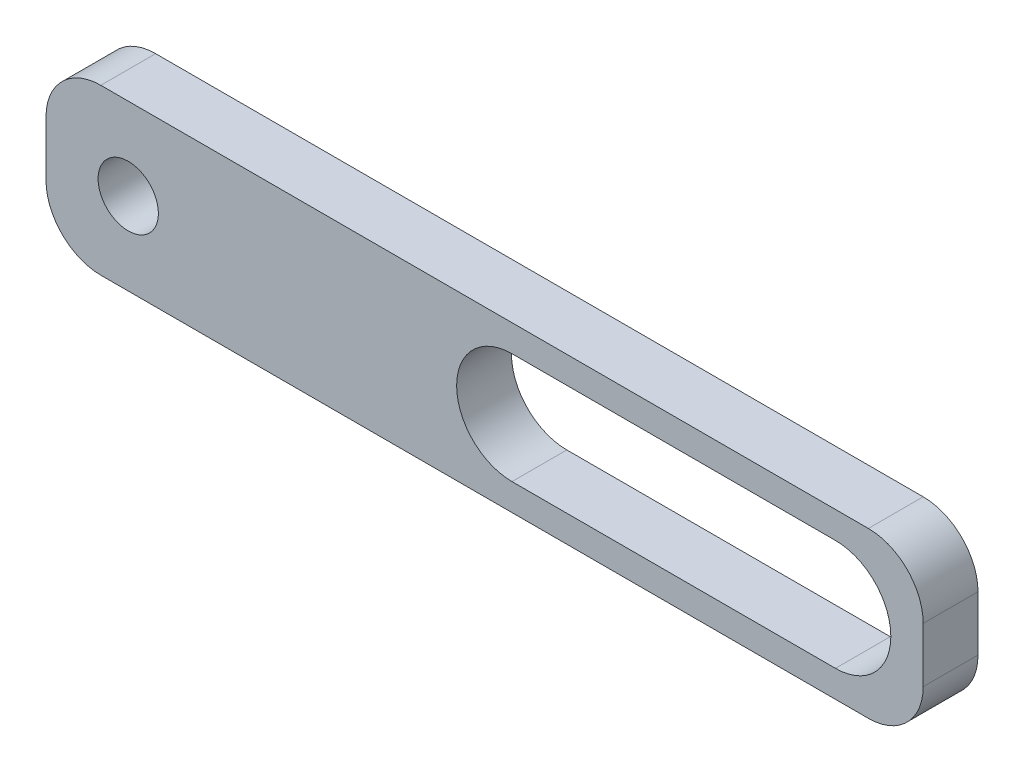
ISO-10303-21;
HEADER;
FILE_DESCRIPTION(('STEP AP214'),'2;1');
FILE_NAME('part.step','',(''),(''),'','','');
FILE_SCHEMA(('AUTOMOTIVE_DESIGN { 1 0 10303 214 1 1 1 1 }'));
ENDSEC;
DATA;
#1=APPLICATION_CONTEXT('core data for automotive mechanical design processes');
#2=APPLICATION_PROTOCOL_DEFINITION('international standard','automotive_design',2000,#1);
#3=PRODUCT_CONTEXT('',#1,'mechanical');
#4=PRODUCT('Part','Part','',(#3));
#5=PRODUCT_RELATED_PRODUCT_CATEGORY('part','',(#4));
#6=PRODUCT_DEFINITION_FORMATION('','',#4);
#7=PRODUCT_DEFINITION_CONTEXT('part definition',#1,'design');
#8=PRODUCT_DEFINITION('design','',#6,#7);
#9=PRODUCT_DEFINITION_SHAPE('','',#8);
#10=(LENGTH_UNIT() NAMED_UNIT(*) SI_UNIT(.MILLI.,.METRE.));
#11=(NAMED_UNIT(*) PLANE_ANGLE_UNIT() SI_UNIT($,.RADIAN.));
#12=(NAMED_UNIT(*) SI_UNIT($,.STERADIAN.) SOLID_ANGLE_UNIT());
#13=UNCERTAINTY_MEASURE_WITH_UNIT(LENGTH_MEASURE(1.E-05),#10,'distance_accuracy_value','');
#14=(GEOMETRIC_REPRESENTATION_CONTEXT(3) GLOBAL_UNCERTAINTY_ASSIGNED_CONTEXT((#13)) GLOBAL_UNIT_ASSIGNED_CONTEXT((#10,
#11,#12)) REPRESENTATION_CONTEXT('',''));
#15=CARTESIAN_POINT('',(0.,0.,0.));
#16=DIRECTION('',(0.,0.,1.));
#17=DIRECTION('',(1.,0.,0.));
#18=AXIS2_PLACEMENT_3D('',#15,#16,#17);
#19=CARTESIAN_POINT('',(5.,5.,5.));
#20=DIRECTION('',(0.,0.,-1.));
#21=DIRECTION('',(-1.,0.,0.));
#22=AXIS2_PLACEMENT_3D('',#19,#20,#21);
#23=PLANE('',#22);
#24=CARTESIAN_POINT('',(5.,5.,5.));
#25=DIRECTION('',(0.,0.,1.));
#26=DIRECTION('',(-1.,0.,0.));
#27=AXIS2_PLACEMENT_3D('',#24,#25,#26);
#28=CIRCLE('',#27,5.);
#29=CARTESIAN_POINT('',(0.,5.00000000000004,5.));
#30=VERTEX_POINT('',#29);
#31=CARTESIAN_POINT('',(5.00000000000004,0.,5.));
#32=VERTEX_POINT('',#31);
#33=EDGE_CURVE('E180',#30,#32,#28,.T.);
#34=ORIENTED_EDGE('',*,*,#33,.T.);
#35=DIRECTION('',(1.,0.,0.));
#36=VECTOR('',#35,1.);
#37=CARTESIAN_POINT('',(75.,0.,5.));
#38=LINE('',#37,#36);
#39=CARTESIAN_POINT('',(75.,0.,5.));
#40=VERTEX_POINT('',#39);
#41=EDGE_CURVE('E184',#32,#40,#38,.T.);
#42=ORIENTED_EDGE('',*,*,#41,.T.);
#43=CARTESIAN_POINT('',(75.,5.,5.));
#44=DIRECTION('',(0.,0.,1.));
#45=DIRECTION('',(1.,0.,0.));
#46=AXIS2_PLACEMENT_3D('',#43,#44,#45);
#47=CIRCLE('',#46,5.00000000000001);
#48=CARTESIAN_POINT('',(80.,5.,5.));
#49=VERTEX_POINT('',#48);
#50=EDGE_CURVE('E188',#40,#49,#47,.T.);
#51=ORIENTED_EDGE('',*,*,#50,.T.);
#52=DIRECTION('',(0.,1.,0.));
#53=VECTOR('',#52,1.);
#54=CARTESIAN_POINT('',(80.,9.99999999999999,5.));
#55=LINE('',#54,#53);
#56=CARTESIAN_POINT('',(80.,9.99999999999999,5.));
#57=VERTEX_POINT('',#56);
#58=EDGE_CURVE('E191',#49,#57,#55,.T.);
#59=ORIENTED_EDGE('',*,*,#58,.T.);
#60=CARTESIAN_POINT('',(75.,9.99999999999999,5.));
#61=DIRECTION('',(0.,0.,1.));
#62=DIRECTION('',(1.,0.,0.));
#63=AXIS2_PLACEMENT_3D('',#60,#61,#62);
#64=CIRCLE('',#63,5.);
#65=CARTESIAN_POINT('',(75.,15.,5.));
#66=VERTEX_POINT('',#65);
#67=EDGE_CURVE('E194',#57,#66,#64,.T.);
#68=ORIENTED_EDGE('',*,*,#67,.T.);
#69=DIRECTION('',(-1.,0.,0.));
#70=VECTOR('',#69,1.);
#71=CARTESIAN_POINT('',(5.,15.,5.));
#72=LINE('',#71,#70);
#73=CARTESIAN_POINT('',(5.,15.,5.));
#74=VERTEX_POINT('',#73);
#75=EDGE_CURVE('E197',#66,#74,#72,.T.);
#76=ORIENTED_EDGE('',*,*,#75,.T.);
#77=CARTESIAN_POINT('',(5.,9.99999999999999,5.));
#78=DIRECTION('',(0.,0.,1.));
#79=DIRECTION('',(-1.,0.,0.));
#80=AXIS2_PLACEMENT_3D('',#77,#78,#79);
#81=CIRCLE('',#80,5.);
#82=CARTESIAN_POINT('',(0.,9.99999999999999,5.));
#83=VERTEX_POINT('',#82);
#84=EDGE_CURVE('E200',#74,#83,#81,.T.);
#85=ORIENTED_EDGE('',*,*,#84,.T.);
#86=DIRECTION('',(0.,-1.,0.));
#87=VECTOR('',#86,1.);
#88=CARTESIAN_POINT('',(0.,5.00000000000004,5.));
#89=LINE('',#88,#87);
#90=EDGE_CURVE('E203',#83,#30,#89,.T.);
#91=ORIENTED_EDGE('',*,*,#90,.T.);
#92=EDGE_LOOP('',(#34,#42,#51,#59,#68,#76,#85,#91));
#93=FACE_BOUND('',#92,.T.);
#94=CARTESIAN_POINT('',(42.5,7.50000000000001,5.));
#95=DIRECTION('',(0.,0.,1.));
#96=DIRECTION('',(1.,0.,0.));
#97=AXIS2_PLACEMENT_3D('',#94,#95,#96);
#98=CIRCLE('',#97,5.05);
#99=CARTESIAN_POINT('',(42.5,12.55,5.));
#100=VERTEX_POINT('',#99);
#101=CARTESIAN_POINT('',(42.5,2.45000000000001,5.));
#102=VERTEX_POINT('',#101);
#103=EDGE_CURVE('E129',#100,#102,#98,.T.);
#104=ORIENTED_EDGE('',*,*,#103,.F.);
#105=DIRECTION('',(-1.,0.,0.));
#106=VECTOR('',#105,1.);
#107=CARTESIAN_POINT('',(42.5,12.55,5.));
#108=LINE('',#107,#106);
#109=CARTESIAN_POINT('',(72.,12.55,5.));
#110=VERTEX_POINT('',#109);
#111=EDGE_CURVE('E156',#110,#100,#108,.T.);
#112=ORIENTED_EDGE('',*,*,#111,.F.);
#113=CARTESIAN_POINT('',(72.,7.50000000000001,5.));
#114=DIRECTION('',(0.,0.,1.));
#115=DIRECTION('',(1.,0.,0.));
#116=AXIS2_PLACEMENT_3D('',#113,#114,#115);
#117=CIRCLE('',#116,5.04999999999999);
#118=CARTESIAN_POINT('',(72.,2.45000000000001,5.));
#119=VERTEX_POINT('',#118);
#120=EDGE_CURVE('E152',#119,#110,#117,.T.);
#121=ORIENTED_EDGE('',*,*,#120,.F.);
#122=DIRECTION('',(1.,0.,0.));
#123=VECTOR('',#122,1.);
#124=CARTESIAN_POINT('',(42.5,2.45000000000001,5.));
#125=LINE('',#124,#123);
#126=EDGE_CURVE('E138',#102,#119,#125,.T.);
#127=ORIENTED_EDGE('',*,*,#126,.F.);
#128=EDGE_LOOP('',(#104,#112,#121,#127));
#129=FACE_BOUND('',#128,.T.);
#130=CARTESIAN_POINT('',(7.5,7.50000000000001,5.));
#131=DIRECTION('',(0.,0.,1.));
#132=DIRECTION('',(1.,0.,0.));
#133=AXIS2_PLACEMENT_3D('',#130,#131,#132);
#134=CIRCLE('',#133,2.75);
#135=CARTESIAN_POINT('',(10.25,7.50000000000001,5.));
#136=VERTEX_POINT('',#135);
#137=EDGE_CURVE('E164',#136,#136,#134,.T.);
#138=ORIENTED_EDGE('',*,*,#137,.F.);
#139=EDGE_LOOP('',(#138));
#140=FACE_BOUND('',#139,.T.);
#141=ADVANCED_FACE('F39',(#93,#129,#140),#23,.F.);
#142=CARTESIAN_POINT('',(5.,5.,0.));
#143=DIRECTION('',(0.,0.,-1.));
#144=DIRECTION('',(-1.,0.,0.));
#145=AXIS2_PLACEMENT_3D('',#142,#143,#144);
#146=PLANE('',#145);
#147=DIRECTION('',(-1.,0.,0.));
#148=VECTOR('',#147,1.);
#149=CARTESIAN_POINT('',(42.5,12.55,0.));
#150=LINE('',#149,#148);
#151=CARTESIAN_POINT('',(72.,12.55,0.));
#152=VERTEX_POINT('',#151);
#153=CARTESIAN_POINT('',(42.5,12.55,0.));
#154=VERTEX_POINT('',#153);
#155=EDGE_CURVE('E139',#152,#154,#150,.T.);
#156=ORIENTED_EDGE('',*,*,#155,.T.);
#157=CARTESIAN_POINT('',(42.5,7.50000000000001,0.));
#158=DIRECTION('',(0.,0.,1.));
#159=DIRECTION('',(1.,0.,0.));
#160=AXIS2_PLACEMENT_3D('',#157,#158,#159);
#161=CIRCLE('',#160,5.05);
#162=CARTESIAN_POINT('',(42.5,2.45000000000001,0.));
#163=VERTEX_POINT('',#162);
#164=EDGE_CURVE('E63',#154,#163,#161,.T.);
#165=ORIENTED_EDGE('',*,*,#164,.T.);
#166=DIRECTION('',(1.,0.,0.));
#167=VECTOR('',#166,1.);
#168=CARTESIAN_POINT('',(42.5,2.45000000000001,0.));
#169=LINE('',#168,#167);
#170=CARTESIAN_POINT('',(72.,2.45000000000001,0.));
#171=VERTEX_POINT('',#170);
#172=EDGE_CURVE('E145',#163,#171,#169,.T.);
#173=ORIENTED_EDGE('',*,*,#172,.T.);
#174=CARTESIAN_POINT('',(72.,7.50000000000001,0.));
#175=DIRECTION('',(0.,0.,1.));
#176=DIRECTION('',(1.,0.,0.));
#177=AXIS2_PLACEMENT_3D('',#174,#175,#176);
#178=CIRCLE('',#177,5.04999999999999);
#179=EDGE_CURVE('E167',#171,#152,#178,.T.);
#180=ORIENTED_EDGE('',*,*,#179,.T.);
#181=EDGE_LOOP('',(#156,#165,#173,#180));
#182=FACE_BOUND('',#181,.T.);
#183=CARTESIAN_POINT('',(5.,5.,0.));
#184=DIRECTION('',(0.,0.,1.));
#185=DIRECTION('',(-1.,0.,0.));
#186=AXIS2_PLACEMENT_3D('',#183,#184,#185);
#187=CIRCLE('',#186,5.);
#188=CARTESIAN_POINT('',(0.,5.00000000000004,0.));
#189=VERTEX_POINT('',#188);
#190=CARTESIAN_POINT('',(5.00000000000004,0.,0.));
#191=VERTEX_POINT('',#190);
#192=EDGE_CURVE('E147',#189,#191,#187,.T.);
#193=ORIENTED_EDGE('',*,*,#192,.F.);
#194=DIRECTION('',(0.,-1.,0.));
#195=VECTOR('',#194,1.);
#196=CARTESIAN_POINT('',(0.,5.00000000000004,0.));
#197=LINE('',#196,#195);
#198=CARTESIAN_POINT('',(0.,9.99999999999999,0.));
#199=VERTEX_POINT('',#198);
#200=EDGE_CURVE('E185',#199,#189,#197,.T.);
#201=ORIENTED_EDGE('',*,*,#200,.F.);
#202=CARTESIAN_POINT('',(5.,9.99999999999999,0.));
#203=DIRECTION('',(0.,0.,1.));
#204=DIRECTION('',(-1.,0.,0.));
#205=AXIS2_PLACEMENT_3D('',#202,#203,#204);
#206=CIRCLE('',#205,5.);
#207=CARTESIAN_POINT('',(5.,15.,0.));
#208=VERTEX_POINT('',#207);
#209=EDGE_CURVE('E225',#208,#199,#206,.T.);
#210=ORIENTED_EDGE('',*,*,#209,.F.);
#211=DIRECTION('',(-1.,0.,0.));
#212=VECTOR('',#211,1.);
#213=CARTESIAN_POINT('',(5.,15.,0.));
#214=LINE('',#213,#212);
#215=CARTESIAN_POINT('',(75.,15.,0.));
#216=VERTEX_POINT('',#215);
#217=EDGE_CURVE('E222',#216,#208,#214,.T.);
#218=ORIENTED_EDGE('',*,*,#217,.F.);
#219=CARTESIAN_POINT('',(75.,9.99999999999999,0.));
#220=DIRECTION('',(0.,0.,1.));
#221=DIRECTION('',(1.,0.,0.));
#222=AXIS2_PLACEMENT_3D('',#219,#220,#221);
#223=CIRCLE('',#222,5.);
#224=CARTESIAN_POINT('',(80.,9.99999999999999,0.));
#225=VERTEX_POINT('',#224);
#226=EDGE_CURVE('E219',#225,#216,#223,.T.);
#227=ORIENTED_EDGE('',*,*,#226,.F.);
#228=DIRECTION('',(0.,1.,0.));
#229=VECTOR('',#228,1.);
#230=CARTESIAN_POINT('',(80.,9.99999999999999,0.));
#231=LINE('',#230,#229);
#232=CARTESIAN_POINT('',(80.,5.,0.));
#233=VERTEX_POINT('',#232);
#234=EDGE_CURVE('E216',#233,#225,#231,.T.);
#235=ORIENTED_EDGE('',*,*,#234,.F.);
#236=CARTESIAN_POINT('',(75.,5.,0.));
#237=DIRECTION('',(0.,0.,1.));
#238=DIRECTION('',(1.,0.,0.));
#239=AXIS2_PLACEMENT_3D('',#236,#237,#238);
#240=CIRCLE('',#239,5.00000000000001);
#241=CARTESIAN_POINT('',(75.,0.,0.));
#242=VERTEX_POINT('',#241);
#243=EDGE_CURVE('E213',#242,#233,#240,.T.);
#244=ORIENTED_EDGE('',*,*,#243,.F.);
#245=DIRECTION('',(1.,0.,0.));
#246=VECTOR('',#245,1.);
#247=CARTESIAN_POINT('',(75.,0.,0.));
#248=LINE('',#247,#246);
#249=EDGE_CURVE('E210',#191,#242,#248,.T.);
#250=ORIENTED_EDGE('',*,*,#249,.F.);
#251=EDGE_LOOP('',(#193,#201,#210,#218,#227,#235,#244,#250));
#252=FACE_BOUND('',#251,.T.);
#253=CARTESIAN_POINT('',(7.5,7.50000000000001,0.));
#254=DIRECTION('',(0.,0.,1.));
#255=DIRECTION('',(1.,0.,0.));
#256=AXIS2_PLACEMENT_3D('',#253,#254,#255);
#257=CIRCLE('',#256,2.75);
#258=CARTESIAN_POINT('',(10.25,7.50000000000001,0.));
#259=VERTEX_POINT('',#258);
#260=EDGE_CURVE('E340',#259,#259,#257,.T.);
#261=ORIENTED_EDGE('',*,*,#260,.T.);
#262=EDGE_LOOP('',(#261));
#263=FACE_BOUND('',#262,.T.);
#264=ADVANCED_FACE('F264',(#182,#252,#263),#146,.T.);
#265=CARTESIAN_POINT('',(5.,5.,5.));
#266=DIRECTION('',(0.,0.,-1.));
#267=DIRECTION('',(-1.,0.,0.));
#268=AXIS2_PLACEMENT_3D('',#265,#266,#267);
#269=CYLINDRICAL_SURFACE('',#268,5.);
#270=ORIENTED_EDGE('',*,*,#192,.T.);
#271=DIRECTION('',(0.,0.,-1.));
#272=VECTOR('',#271,1.);
#273=CARTESIAN_POINT('',(5.00000000000004,0.,5.));
#274=LINE('',#273,#272);
#275=EDGE_CURVE('E11',#32,#191,#274,.T.);
#276=ORIENTED_EDGE('',*,*,#275,.F.);
#277=ORIENTED_EDGE('',*,*,#33,.F.);
#278=DIRECTION('',(0.,0.,-1.));
#279=VECTOR('',#278,1.);
#280=CARTESIAN_POINT('',(0.,5.00000000000004,5.));
#281=LINE('',#280,#279);
#282=EDGE_CURVE('E206',#30,#189,#281,.T.);
#283=ORIENTED_EDGE('',*,*,#282,.T.);
#284=EDGE_LOOP('',(#270,#276,#277,#283));
#285=FACE_BOUND('',#284,.T.);
#286=ADVANCED_FACE('F41',(#285),#269,.T.);
#287=CARTESIAN_POINT('',(75.,0.,5.));
#288=DIRECTION('',(0.,1.,0.));
#289=DIRECTION('',(-1.,0.,0.));
#290=AXIS2_PLACEMENT_3D('',#287,#288,#289);
#291=PLANE('',#290);
#292=ORIENTED_EDGE('',*,*,#249,.T.);
#293=DIRECTION('',(0.,0.,-1.));
#294=VECTOR('',#293,1.);
#295=CARTESIAN_POINT('',(75.,0.,5.));
#296=LINE('',#295,#294);
#297=EDGE_CURVE('E48',#40,#242,#296,.T.);
#298=ORIENTED_EDGE('',*,*,#297,.F.);
#299=ORIENTED_EDGE('',*,*,#41,.F.);
#300=ORIENTED_EDGE('',*,*,#275,.T.);
#301=EDGE_LOOP('',(#292,#298,#299,#300));
#302=FACE_BOUND('',#301,.T.);
#303=ADVANCED_FACE('F281',(#302),#291,.F.);
#304=CARTESIAN_POINT('',(75.,5.,5.));
#305=DIRECTION('',(0.,0.,-1.));
#306=DIRECTION('',(-1.,0.,0.));
#307=AXIS2_PLACEMENT_3D('',#304,#305,#306);
#308=CYLINDRICAL_SURFACE('',#307,5.00000000000001);
#309=ORIENTED_EDGE('',*,*,#243,.T.);
#310=DIRECTION('',(0.,0.,-1.));
#311=VECTOR('',#310,1.);
#312=CARTESIAN_POINT('',(80.,5.,5.));
#313=LINE('',#312,#311);
#314=EDGE_CURVE('E249',#49,#233,#313,.T.);
#315=ORIENTED_EDGE('',*,*,#314,.F.);
#316=ORIENTED_EDGE('',*,*,#50,.F.);
#317=ORIENTED_EDGE('',*,*,#297,.T.);
#318=EDGE_LOOP('',(#309,#315,#316,#317));
#319=FACE_BOUND('',#318,.T.);
#320=ADVANCED_FACE('F258',(#319),#308,.T.);
#321=CARTESIAN_POINT('',(80.,9.99999999999999,5.));
#322=DIRECTION('',(-1.,0.,0.));
#323=DIRECTION('',(0.,0.,1.));
#324=AXIS2_PLACEMENT_3D('',#321,#322,#323);
#325=PLANE('',#324);
#326=ORIENTED_EDGE('',*,*,#234,.T.);
#327=DIRECTION('',(0.,0.,-1.));
#328=VECTOR('',#327,1.);
#329=CARTESIAN_POINT('',(80.,9.99999999999999,5.));
#330=LINE('',#329,#328);
#331=EDGE_CURVE('E245',#57,#225,#330,.T.);
#332=ORIENTED_EDGE('',*,*,#331,.F.);
#333=ORIENTED_EDGE('',*,*,#58,.F.);
#334=ORIENTED_EDGE('',*,*,#314,.T.);
#335=EDGE_LOOP('',(#326,#332,#333,#334));
#336=FACE_BOUND('',#335,.T.);
#337=ADVANCED_FACE('F270',(#336),#325,.F.);
#338=CARTESIAN_POINT('',(75.,9.99999999999999,5.));
#339=DIRECTION('',(0.,0.,-1.));
#340=DIRECTION('',(-1.,0.,0.));
#341=AXIS2_PLACEMENT_3D('',#338,#339,#340);
#342=CYLINDRICAL_SURFACE('',#341,5.);
#343=ORIENTED_EDGE('',*,*,#226,.T.);
#344=DIRECTION('',(0.,0.,-1.));
#345=VECTOR('',#344,1.);
#346=CARTESIAN_POINT('',(75.,15.,5.));
#347=LINE('',#346,#345);
#348=EDGE_CURVE('E241',#66,#216,#347,.T.);
#349=ORIENTED_EDGE('',*,*,#348,.F.);
#350=ORIENTED_EDGE('',*,*,#67,.F.);
#351=ORIENTED_EDGE('',*,*,#331,.T.);
#352=EDGE_LOOP('',(#343,#349,#350,#351));
#353=FACE_BOUND('',#352,.T.);
#354=ADVANCED_FACE('F274',(#353),#342,.T.);
#355=CARTESIAN_POINT('',(5.,15.,5.));
#356=DIRECTION('',(0.,-1.,0.));
#357=DIRECTION('',(0.,0.,-1.));
#358=AXIS2_PLACEMENT_3D('',#355,#356,#357);
#359=PLANE('',#358);
#360=ORIENTED_EDGE('',*,*,#217,.T.);
#361=DIRECTION('',(0.,0.,-1.));
#362=VECTOR('',#361,1.);
#363=CARTESIAN_POINT('',(5.,15.,5.));
#364=LINE('',#363,#362);
#365=EDGE_CURVE('E237',#74,#208,#364,.T.);
#366=ORIENTED_EDGE('',*,*,#365,.F.);
#367=ORIENTED_EDGE('',*,*,#75,.F.);
#368=ORIENTED_EDGE('',*,*,#348,.T.);
#369=EDGE_LOOP('',(#360,#366,#367,#368));
#370=FACE_BOUND('',#369,.T.);
#371=ADVANCED_FACE('F294',(#370),#359,.F.);
#372=CARTESIAN_POINT('',(5.,9.99999999999999,5.));
#373=DIRECTION('',(0.,0.,-1.));
#374=DIRECTION('',(-1.,0.,0.));
#375=AXIS2_PLACEMENT_3D('',#372,#373,#374);
#376=CYLINDRICAL_SURFACE('',#375,5.);
#377=ORIENTED_EDGE('',*,*,#209,.T.);
#378=DIRECTION('',(0.,0.,-1.));
#379=VECTOR('',#378,1.);
#380=CARTESIAN_POINT('',(0.,9.99999999999999,5.));
#381=LINE('',#380,#379);
#382=EDGE_CURVE('E233',#83,#199,#381,.T.);
#383=ORIENTED_EDGE('',*,*,#382,.F.);
#384=ORIENTED_EDGE('',*,*,#84,.F.);
#385=ORIENTED_EDGE('',*,*,#365,.T.);
#386=EDGE_LOOP('',(#377,#383,#384,#385));
#387=FACE_BOUND('',#386,.T.);
#388=ADVANCED_FACE('F292',(#387),#376,.T.);
#389=CARTESIAN_POINT('',(0.,5.00000000000004,5.));
#390=DIRECTION('',(1.,0.,0.));
#391=DIRECTION('',(0.,0.,-1.));
#392=AXIS2_PLACEMENT_3D('',#389,#390,#391);
#393=PLANE('',#392);
#394=ORIENTED_EDGE('',*,*,#200,.T.);
#395=ORIENTED_EDGE('',*,*,#282,.F.);
#396=ORIENTED_EDGE('',*,*,#90,.F.);
#397=ORIENTED_EDGE('',*,*,#382,.T.);
#398=EDGE_LOOP('',(#394,#395,#396,#397));
#399=FACE_BOUND('',#398,.T.);
#400=ADVANCED_FACE('F287',(#399),#393,.F.);
#401=CARTESIAN_POINT('',(42.5,7.50000000000001,5.));
#402=DIRECTION('',(0.,0.,-1.));
#403=DIRECTION('',(-1.,0.,0.));
#404=AXIS2_PLACEMENT_3D('',#401,#402,#403);
#405=CYLINDRICAL_SURFACE('',#404,5.05);
#406=ORIENTED_EDGE('',*,*,#164,.F.);
#407=DIRECTION('',(0.,0.,-1.));
#408=VECTOR('',#407,1.);
#409=CARTESIAN_POINT('',(42.5,12.55,5.));
#410=LINE('',#409,#408);
#411=EDGE_CURVE('E133',#100,#154,#410,.T.);
#412=ORIENTED_EDGE('',*,*,#411,.F.);
#413=ORIENTED_EDGE('',*,*,#103,.T.);
#414=DIRECTION('',(0.,0.,-1.));
#415=VECTOR('',#414,1.);
#416=CARTESIAN_POINT('',(42.5,2.45000000000001,5.));
#417=LINE('',#416,#415);
#418=EDGE_CURVE('E132',#102,#163,#417,.T.);
#419=ORIENTED_EDGE('',*,*,#418,.T.);
#420=EDGE_LOOP('',(#406,#412,#413,#419));
#421=FACE_BOUND('',#420,.T.);
#422=ADVANCED_FACE('F131',(#421),#405,.F.);
#423=CARTESIAN_POINT('',(42.5,2.45000000000001,5.));
#424=DIRECTION('',(0.,1.,0.));
#425=DIRECTION('',(-1.,0.,0.));
#426=AXIS2_PLACEMENT_3D('',#423,#424,#425);
#427=PLANE('',#426);
#428=ORIENTED_EDGE('',*,*,#172,.F.);
#429=ORIENTED_EDGE('',*,*,#418,.F.);
#430=ORIENTED_EDGE('',*,*,#126,.T.);
#431=DIRECTION('',(0.,0.,-1.));
#432=VECTOR('',#431,1.);
#433=CARTESIAN_POINT('',(72.,2.45000000000001,5.));
#434=LINE('',#433,#432);
#435=EDGE_CURVE('E148',#119,#171,#434,.T.);
#436=ORIENTED_EDGE('',*,*,#435,.T.);
#437=EDGE_LOOP('',(#428,#429,#430,#436));
#438=FACE_BOUND('',#437,.T.);
#439=ADVANCED_FACE('F142',(#438),#427,.T.);
#440=CARTESIAN_POINT('',(72.,7.50000000000001,5.));
#441=DIRECTION('',(0.,0.,-1.));
#442=DIRECTION('',(-1.,0.,0.));
#443=AXIS2_PLACEMENT_3D('',#440,#441,#442);
#444=CYLINDRICAL_SURFACE('',#443,5.04999999999999);
#445=ORIENTED_EDGE('',*,*,#179,.F.);
#446=ORIENTED_EDGE('',*,*,#435,.F.);
#447=ORIENTED_EDGE('',*,*,#120,.T.);
#448=DIRECTION('',(0.,0.,-1.));
#449=VECTOR('',#448,1.);
#450=CARTESIAN_POINT('',(72.,12.55,5.));
#451=LINE('',#450,#449);
#452=EDGE_CURVE('E55',#110,#152,#451,.T.);
#453=ORIENTED_EDGE('',*,*,#452,.T.);
#454=EDGE_LOOP('',(#445,#446,#447,#453));
#455=FACE_BOUND('',#454,.T.);
#456=ADVANCED_FACE('F320',(#455),#444,.F.);
#457=CARTESIAN_POINT('',(42.5,12.55,5.));
#458=DIRECTION('',(0.,-1.,0.));
#459=DIRECTION('',(1.,0.,0.));
#460=AXIS2_PLACEMENT_3D('',#457,#458,#459);
#461=PLANE('',#460);
#462=ORIENTED_EDGE('',*,*,#155,.F.);
#463=ORIENTED_EDGE('',*,*,#452,.F.);
#464=ORIENTED_EDGE('',*,*,#111,.T.);
#465=ORIENTED_EDGE('',*,*,#411,.T.);
#466=EDGE_LOOP('',(#462,#463,#464,#465));
#467=FACE_BOUND('',#466,.T.);
#468=ADVANCED_FACE('F324',(#467),#461,.T.);
#469=CARTESIAN_POINT('',(7.5,7.50000000000001,5.));
#470=DIRECTION('',(0.,0.,-1.));
#471=DIRECTION('',(-1.,0.,0.));
#472=AXIS2_PLACEMENT_3D('',#469,#470,#471);
#473=CYLINDRICAL_SURFACE('',#472,2.75);
#474=ORIENTED_EDGE('',*,*,#137,.T.);
#475=EDGE_LOOP('',(#474));
#476=FACE_BOUND('',#475,.T.);
#477=ORIENTED_EDGE('',*,*,#260,.F.);
#478=EDGE_LOOP('',(#477));
#479=FACE_BOUND('',#478,.T.);
#480=ADVANCED_FACE('F330',(#476,#479),#473,.F.);
#481=CLOSED_SHELL('',(#141,#264,#286,#303,#320,#337,#354,#371,#388,#400,#422,#439,#456,#468,#480));
#482=MANIFOLD_SOLID_BREP('B2',#481);
#483=ADVANCED_BREP_SHAPE_REPRESENTATION('',(#18,#482),#14);
#484=SHAPE_DEFINITION_REPRESENTATION(#9,#483);
ENDSEC;
END-ISO-10303-21;
